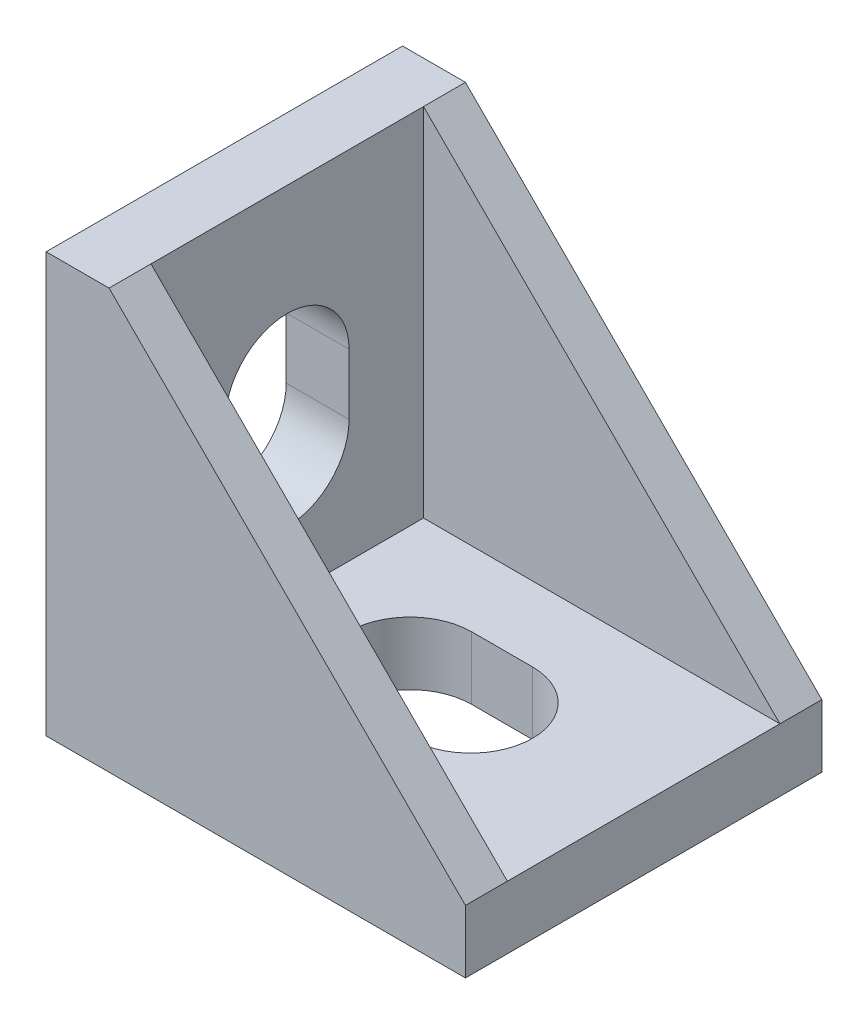
ISO-10303-21;
HEADER;
FILE_DESCRIPTION(('STEP AP214'),'2;1');
FILE_NAME('part.step','',(''),(''),'','','');
FILE_SCHEMA(('AUTOMOTIVE_DESIGN { 1 0 10303 214 1 1 1 1 }'));
ENDSEC;
DATA;
#1=APPLICATION_CONTEXT('core data for automotive mechanical design processes');
#2=APPLICATION_PROTOCOL_DEFINITION('international standard','automotive_design',2000,#1);
#3=PRODUCT_CONTEXT('',#1,'mechanical');
#4=PRODUCT('Part','Part','',(#3));
#5=PRODUCT_RELATED_PRODUCT_CATEGORY('part','',(#4));
#6=PRODUCT_DEFINITION_FORMATION('','',#4);
#7=PRODUCT_DEFINITION_CONTEXT('part definition',#1,'design');
#8=PRODUCT_DEFINITION('design','',#6,#7);
#9=PRODUCT_DEFINITION_SHAPE('','',#8);
#10=(LENGTH_UNIT() NAMED_UNIT(*) SI_UNIT(.MILLI.,.METRE.));
#11=(NAMED_UNIT(*) PLANE_ANGLE_UNIT() SI_UNIT($,.RADIAN.));
#12=(NAMED_UNIT(*) SI_UNIT($,.STERADIAN.) SOLID_ANGLE_UNIT());
#13=UNCERTAINTY_MEASURE_WITH_UNIT(LENGTH_MEASURE(1.E-05),#10,'distance_accuracy_value','');
#14=(GEOMETRIC_REPRESENTATION_CONTEXT(3) GLOBAL_UNCERTAINTY_ASSIGNED_CONTEXT((#13)) GLOBAL_UNIT_ASSIGNED_CONTEXT((#10,
#11,#12)) REPRESENTATION_CONTEXT('',''));
#15=CARTESIAN_POINT('',(0.,0.,0.));
#16=DIRECTION('',(0.,0.,1.));
#17=DIRECTION('',(1.,0.,0.));
#18=AXIS2_PLACEMENT_3D('',#15,#16,#17);
#19=CARTESIAN_POINT('',(3.,20.,17.));
#20=DIRECTION('',(-0.707106781186548,-0.707106781186548,0.));
#21=DIRECTION('',(0.707106781186548,-0.707106781186548,0.));
#22=AXIS2_PLACEMENT_3D('',#19,#20,#21);
#23=PLANE('',#22);
#24=DIRECTION('',(-0.707106781186548,0.707106781186548,0.));
#25=VECTOR('',#24,1.);
#26=CARTESIAN_POINT('',(3.,20.,2.));
#27=LINE('',#26,#25);
#28=CARTESIAN_POINT('',(20.,3.,2.));
#29=VERTEX_POINT('',#28);
#30=CARTESIAN_POINT('',(3.,20.,2.));
#31=VERTEX_POINT('',#30);
#32=EDGE_CURVE('E11',#29,#31,#27,.T.);
#33=ORIENTED_EDGE('',*,*,#32,.F.);
#34=DIRECTION('',(0.,0.,-1.));
#35=VECTOR('',#34,1.);
#36=CARTESIAN_POINT('',(20.,3.,17.));
#37=LINE('',#36,#35);
#38=CARTESIAN_POINT('',(20.,3.,0.));
#39=VERTEX_POINT('',#38);
#40=EDGE_CURVE('E264',#29,#39,#37,.T.);
#41=ORIENTED_EDGE('',*,*,#40,.T.);
#42=DIRECTION('',(-0.707106781186547,0.707106781186547,0.));
#43=VECTOR('',#42,1.);
#44=CARTESIAN_POINT('',(3.,20.,0.));
#45=LINE('',#44,#43);
#46=CARTESIAN_POINT('',(3.,20.,0.));
#47=VERTEX_POINT('',#46);
#48=EDGE_CURVE('E254',#39,#47,#45,.T.);
#49=ORIENTED_EDGE('',*,*,#48,.T.);
#50=DIRECTION('',(0.,0.,-1.));
#51=VECTOR('',#50,1.);
#52=CARTESIAN_POINT('',(3.,20.,17.));
#53=LINE('',#52,#51);
#54=EDGE_CURVE('E260',#31,#47,#53,.T.);
#55=ORIENTED_EDGE('',*,*,#54,.F.);
#56=EDGE_LOOP('',(#33,#41,#49,#55));
#57=FACE_BOUND('',#56,.T.);
#58=ADVANCED_FACE('F34',(#57),#23,.F.);
#59=CARTESIAN_POINT('',(0.,0.,17.));
#60=DIRECTION('',(1.,0.,0.));
#61=DIRECTION('',(0.,0.,-1.));
#62=AXIS2_PLACEMENT_3D('',#59,#60,#61);
#63=PLANE('',#62);
#64=DIRECTION('',(0.,-1.,0.));
#65=VECTOR('',#64,1.);
#66=CARTESIAN_POINT('',(0.,0.,5.55000000000001));
#67=LINE('',#66,#65);
#68=CARTESIAN_POINT('',(0.,11.75,5.55));
#69=VERTEX_POINT('',#68);
#70=CARTESIAN_POINT('',(0.,8.85,5.55));
#71=VERTEX_POINT('',#70);
#72=EDGE_CURVE('E157',#69,#71,#67,.T.);
#73=ORIENTED_EDGE('',*,*,#72,.F.);
#74=CARTESIAN_POINT('',(0.,11.75,8.5));
#75=DIRECTION('',(-1.,0.,0.));
#76=DIRECTION('',(0.,0.,1.));
#77=AXIS2_PLACEMENT_3D('',#74,#75,#76);
#78=CIRCLE('',#77,2.95);
#79=CARTESIAN_POINT('',(0.,11.75,11.45));
#80=VERTEX_POINT('',#79);
#81=EDGE_CURVE('E149',#80,#69,#78,.T.);
#82=ORIENTED_EDGE('',*,*,#81,.F.);
#83=DIRECTION('',(0.,-1.,0.));
#84=VECTOR('',#83,1.);
#85=CARTESIAN_POINT('',(0.,0.,11.45));
#86=LINE('',#85,#84);
#87=CARTESIAN_POINT('',(0.,8.85,11.45));
#88=VERTEX_POINT('',#87);
#89=EDGE_CURVE('E49',#80,#88,#86,.T.);
#90=ORIENTED_EDGE('',*,*,#89,.T.);
#91=CARTESIAN_POINT('',(0.,8.85,8.5));
#92=DIRECTION('',(-1.,0.,0.));
#93=DIRECTION('',(0.,0.,1.));
#94=AXIS2_PLACEMENT_3D('',#91,#92,#93);
#95=CIRCLE('',#94,2.95);
#96=EDGE_CURVE('E161',#71,#88,#95,.T.);
#97=ORIENTED_EDGE('',*,*,#96,.F.);
#98=EDGE_LOOP('',(#73,#82,#90,#97));
#99=FACE_BOUND('',#98,.T.);
#100=DIRECTION('',(0.,-1.,0.));
#101=VECTOR('',#100,1.);
#102=CARTESIAN_POINT('',(0.,0.,0.));
#103=LINE('',#102,#101);
#104=CARTESIAN_POINT('',(0.,20.,0.));
#105=VERTEX_POINT('',#104);
#106=CARTESIAN_POINT('',(0.,0.,0.));
#107=VERTEX_POINT('',#106);
#108=EDGE_CURVE('E232',#105,#107,#103,.T.);
#109=ORIENTED_EDGE('',*,*,#108,.T.);
#110=DIRECTION('',(0.,0.,-1.));
#111=VECTOR('',#110,1.);
#112=CARTESIAN_POINT('',(0.,0.,17.));
#113=LINE('',#112,#111);
#114=CARTESIAN_POINT('',(0.,0.,17.));
#115=VERTEX_POINT('',#114);
#116=EDGE_CURVE('E271',#115,#107,#113,.T.);
#117=ORIENTED_EDGE('',*,*,#116,.F.);
#118=DIRECTION('',(0.,-1.,0.));
#119=VECTOR('',#118,1.);
#120=CARTESIAN_POINT('',(0.,0.,17.));
#121=LINE('',#120,#119);
#122=CARTESIAN_POINT('',(0.,20.,17.));
#123=VERTEX_POINT('',#122);
#124=EDGE_CURVE('E234',#123,#115,#121,.T.);
#125=ORIENTED_EDGE('',*,*,#124,.F.);
#126=DIRECTION('',(0.,0.,-1.));
#127=VECTOR('',#126,1.);
#128=CARTESIAN_POINT('',(0.,20.,17.));
#129=LINE('',#128,#127);
#130=EDGE_CURVE('E246',#123,#105,#129,.T.);
#131=ORIENTED_EDGE('',*,*,#130,.T.);
#132=EDGE_LOOP('',(#109,#117,#125,#131));
#133=FACE_BOUND('',#132,.T.);
#134=ADVANCED_FACE('F36',(#99,#133),#63,.F.);
#135=CARTESIAN_POINT('',(0.,0.,17.));
#136=DIRECTION('',(0.,1.,0.));
#137=DIRECTION('',(0.,0.,1.));
#138=AXIS2_PLACEMENT_3D('',#135,#136,#137);
#139=PLANE('',#138);
#140=CARTESIAN_POINT('',(11.75,0.,8.5));
#141=DIRECTION('',(0.,1.,0.));
#142=DIRECTION('',(0.,0.,1.));
#143=AXIS2_PLACEMENT_3D('',#140,#141,#142);
#144=CIRCLE('',#143,2.95);
#145=CARTESIAN_POINT('',(11.75,0.,11.45));
#146=VERTEX_POINT('',#145);
#147=CARTESIAN_POINT('',(11.75,0.,5.55));
#148=VERTEX_POINT('',#147);
#149=EDGE_CURVE('E194',#146,#148,#144,.T.);
#150=ORIENTED_EDGE('',*,*,#149,.T.);
#151=DIRECTION('',(-1.,0.,0.));
#152=VECTOR('',#151,1.);
#153=CARTESIAN_POINT('',(0.,0.,5.55000000000001));
#154=LINE('',#153,#152);
#155=CARTESIAN_POINT('',(8.85,0.,5.55));
#156=VERTEX_POINT('',#155);
#157=EDGE_CURVE('E184',#148,#156,#154,.T.);
#158=ORIENTED_EDGE('',*,*,#157,.T.);
#159=CARTESIAN_POINT('',(8.85,0.,8.5));
#160=DIRECTION('',(0.,1.,0.));
#161=DIRECTION('',(0.,0.,1.));
#162=AXIS2_PLACEMENT_3D('',#159,#160,#161);
#163=CIRCLE('',#162,2.95);
#164=CARTESIAN_POINT('',(8.85,0.,11.45));
#165=VERTEX_POINT('',#164);
#166=EDGE_CURVE('E187',#156,#165,#163,.T.);
#167=ORIENTED_EDGE('',*,*,#166,.T.);
#168=DIRECTION('',(-1.,0.,0.));
#169=VECTOR('',#168,1.);
#170=CARTESIAN_POINT('',(0.,0.,11.45));
#171=LINE('',#170,#169);
#172=EDGE_CURVE('E191',#146,#165,#171,.T.);
#173=ORIENTED_EDGE('',*,*,#172,.F.);
#174=EDGE_LOOP('',(#150,#158,#167,#173));
#175=FACE_BOUND('',#174,.T.);
#176=DIRECTION('',(1.,0.,0.));
#177=VECTOR('',#176,1.);
#178=CARTESIAN_POINT('',(0.,0.,0.));
#179=LINE('',#178,#177);
#180=CARTESIAN_POINT('',(20.,0.,0.));
#181=VERTEX_POINT('',#180);
#182=EDGE_CURVE('E249',#107,#181,#179,.T.);
#183=ORIENTED_EDGE('',*,*,#182,.T.);
#184=DIRECTION('',(0.,0.,-1.));
#185=VECTOR('',#184,1.);
#186=CARTESIAN_POINT('',(20.,0.,17.));
#187=LINE('',#186,#185);
#188=CARTESIAN_POINT('',(20.,0.,17.));
#189=VERTEX_POINT('',#188);
#190=EDGE_CURVE('E268',#189,#181,#187,.T.);
#191=ORIENTED_EDGE('',*,*,#190,.F.);
#192=DIRECTION('',(1.,0.,0.));
#193=VECTOR('',#192,1.);
#194=CARTESIAN_POINT('',(0.,0.,17.));
#195=LINE('',#194,#193);
#196=EDGE_CURVE('E237',#115,#189,#195,.T.);
#197=ORIENTED_EDGE('',*,*,#196,.F.);
#198=ORIENTED_EDGE('',*,*,#116,.T.);
#199=EDGE_LOOP('',(#183,#191,#197,#198));
#200=FACE_BOUND('',#199,.T.);
#201=ADVANCED_FACE('F324',(#175,#200),#139,.F.);
#202=CARTESIAN_POINT('',(20.,0.,17.));
#203=DIRECTION('',(-1.,0.,0.));
#204=DIRECTION('',(0.,0.,1.));
#205=AXIS2_PLACEMENT_3D('',#202,#203,#204);
#206=PLANE('',#205);
#207=DIRECTION('',(0.,1.,0.));
#208=VECTOR('',#207,1.);
#209=CARTESIAN_POINT('',(20.,0.,0.));
#210=LINE('',#209,#208);
#211=EDGE_CURVE('E251',#181,#39,#210,.T.);
#212=ORIENTED_EDGE('',*,*,#211,.T.);
#213=ORIENTED_EDGE('',*,*,#40,.F.);
#214=DIRECTION('',(0.,0.,1.));
#215=VECTOR('',#214,1.);
#216=CARTESIAN_POINT('',(20.,3.,2.));
#217=LINE('',#216,#215);
#218=CARTESIAN_POINT('',(20.,3.,15.));
#219=VERTEX_POINT('',#218);
#220=EDGE_CURVE('E209',#29,#219,#217,.T.);
#221=ORIENTED_EDGE('',*,*,#220,.T.);
#222=CARTESIAN_POINT('',(20.,3.,17.));
#223=VERTEX_POINT('',#222);
#224=EDGE_CURVE('E265',#223,#219,#37,.T.);
#225=ORIENTED_EDGE('',*,*,#224,.F.);
#226=DIRECTION('',(0.,1.,0.));
#227=VECTOR('',#226,1.);
#228=CARTESIAN_POINT('',(20.,0.,17.));
#229=LINE('',#228,#227);
#230=EDGE_CURVE('E240',#189,#223,#229,.T.);
#231=ORIENTED_EDGE('',*,*,#230,.F.);
#232=ORIENTED_EDGE('',*,*,#190,.T.);
#233=EDGE_LOOP('',(#212,#213,#221,#225,#231,#232));
#234=FACE_BOUND('',#233,.T.);
#235=ADVANCED_FACE('F294',(#234),#206,.F.);
#236=ORIENTED_EDGE('',*,*,#224,.T.);
#237=DIRECTION('',(-0.707106781186548,0.707106781186548,0.));
#238=VECTOR('',#237,1.);
#239=CARTESIAN_POINT('',(3.,20.,15.));
#240=LINE('',#239,#238);
#241=CARTESIAN_POINT('',(3.,20.,15.));
#242=VERTEX_POINT('',#241);
#243=EDGE_CURVE('E42',#219,#242,#240,.T.);
#244=ORIENTED_EDGE('',*,*,#243,.T.);
#245=CARTESIAN_POINT('',(3.,20.,17.));
#246=VERTEX_POINT('',#245);
#247=EDGE_CURVE('E261',#246,#242,#53,.T.);
#248=ORIENTED_EDGE('',*,*,#247,.F.);
#249=DIRECTION('',(-0.707106781186547,0.707106781186547,0.));
#250=VECTOR('',#249,1.);
#251=CARTESIAN_POINT('',(3.,20.,17.));
#252=LINE('',#251,#250);
#253=EDGE_CURVE('E242',#223,#246,#252,.T.);
#254=ORIENTED_EDGE('',*,*,#253,.F.);
#255=EDGE_LOOP('',(#236,#244,#248,#254));
#256=FACE_BOUND('',#255,.T.);
#257=ADVANCED_FACE('F276',(#256),#23,.F.);
#258=CARTESIAN_POINT('',(0.,20.,17.));
#259=DIRECTION('',(0.,-1.,0.));
#260=DIRECTION('',(0.,0.,-1.));
#261=AXIS2_PLACEMENT_3D('',#258,#259,#260);
#262=PLANE('',#261);
#263=DIRECTION('',(-1.,0.,0.));
#264=VECTOR('',#263,1.);
#265=CARTESIAN_POINT('',(0.,20.,0.));
#266=LINE('',#265,#264);
#267=EDGE_CURVE('E238',#47,#105,#266,.T.);
#268=ORIENTED_EDGE('',*,*,#267,.T.);
#269=ORIENTED_EDGE('',*,*,#130,.F.);
#270=DIRECTION('',(-1.,0.,0.));
#271=VECTOR('',#270,1.);
#272=CARTESIAN_POINT('',(0.,20.,17.));
#273=LINE('',#272,#271);
#274=EDGE_CURVE('E244',#246,#123,#273,.T.);
#275=ORIENTED_EDGE('',*,*,#274,.F.);
#276=ORIENTED_EDGE('',*,*,#247,.T.);
#277=DIRECTION('',(0.,0.,1.));
#278=VECTOR('',#277,1.);
#279=CARTESIAN_POINT('',(3.,20.,2.));
#280=LINE('',#279,#278);
#281=EDGE_CURVE('E216',#31,#242,#280,.T.);
#282=ORIENTED_EDGE('',*,*,#281,.F.);
#283=ORIENTED_EDGE('',*,*,#54,.T.);
#284=EDGE_LOOP('',(#268,#269,#275,#276,#282,#283));
#285=FACE_BOUND('',#284,.T.);
#286=ADVANCED_FACE('F285',(#285),#262,.F.);
#287=CARTESIAN_POINT('',(0.,0.,17.));
#288=DIRECTION('',(0.,0.,-1.));
#289=DIRECTION('',(-1.,0.,0.));
#290=AXIS2_PLACEMENT_3D('',#287,#288,#289);
#291=PLANE('',#290);
#292=ORIENTED_EDGE('',*,*,#124,.T.);
#293=ORIENTED_EDGE('',*,*,#196,.T.);
#294=ORIENTED_EDGE('',*,*,#230,.T.);
#295=ORIENTED_EDGE('',*,*,#253,.T.);
#296=ORIENTED_EDGE('',*,*,#274,.T.);
#297=EDGE_LOOP('',(#292,#293,#294,#295,#296));
#298=FACE_BOUND('',#297,.T.);
#299=ADVANCED_FACE('F289',(#298),#291,.F.);
#300=CARTESIAN_POINT('',(0.,0.,0.));
#301=DIRECTION('',(0.,0.,-1.));
#302=DIRECTION('',(-1.,0.,0.));
#303=AXIS2_PLACEMENT_3D('',#300,#301,#302);
#304=PLANE('',#303);
#305=ORIENTED_EDGE('',*,*,#108,.F.);
#306=ORIENTED_EDGE('',*,*,#267,.F.);
#307=ORIENTED_EDGE('',*,*,#48,.F.);
#308=ORIENTED_EDGE('',*,*,#211,.F.);
#309=ORIENTED_EDGE('',*,*,#182,.F.);
#310=EDGE_LOOP('',(#305,#306,#307,#308,#309));
#311=FACE_BOUND('',#310,.T.);
#312=ADVANCED_FACE('F316',(#311),#304,.T.);
#313=CARTESIAN_POINT('',(20.,20.,2.));
#314=DIRECTION('',(0.,0.,1.));
#315=DIRECTION('',(1.,0.,0.));
#316=AXIS2_PLACEMENT_3D('',#313,#314,#315);
#317=PLANE('',#316);
#318=ORIENTED_EDGE('',*,*,#32,.T.);
#319=DIRECTION('',(0.,-1.,0.));
#320=VECTOR('',#319,1.);
#321=CARTESIAN_POINT('',(3.,20.,2.));
#322=LINE('',#321,#320);
#323=CARTESIAN_POINT('',(3.,3.,2.));
#324=VERTEX_POINT('',#323);
#325=EDGE_CURVE('E229',#31,#324,#322,.T.);
#326=ORIENTED_EDGE('',*,*,#325,.T.);
#327=DIRECTION('',(-1.,0.,0.));
#328=VECTOR('',#327,1.);
#329=CARTESIAN_POINT('',(20.,3.,2.));
#330=LINE('',#329,#328);
#331=EDGE_CURVE('E219',#29,#324,#330,.T.);
#332=ORIENTED_EDGE('',*,*,#331,.F.);
#333=EDGE_LOOP('',(#318,#326,#332));
#334=FACE_BOUND('',#333,.T.);
#335=ADVANCED_FACE('F303',(#334),#317,.T.);
#336=CARTESIAN_POINT('',(20.,20.,15.));
#337=DIRECTION('',(0.,0.,1.));
#338=DIRECTION('',(1.,0.,0.));
#339=AXIS2_PLACEMENT_3D('',#336,#337,#338);
#340=PLANE('',#339);
#341=DIRECTION('',(-1.,0.,0.));
#342=VECTOR('',#341,1.);
#343=CARTESIAN_POINT('',(20.,3.,15.));
#344=LINE('',#343,#342);
#345=CARTESIAN_POINT('',(3.,3.,15.));
#346=VERTEX_POINT('',#345);
#347=EDGE_CURVE('E222',#219,#346,#344,.T.);
#348=ORIENTED_EDGE('',*,*,#347,.T.);
#349=DIRECTION('',(0.,-1.,0.));
#350=VECTOR('',#349,1.);
#351=CARTESIAN_POINT('',(3.,20.,15.));
#352=LINE('',#351,#350);
#353=EDGE_CURVE('E218',#242,#346,#352,.T.);
#354=ORIENTED_EDGE('',*,*,#353,.F.);
#355=ORIENTED_EDGE('',*,*,#243,.F.);
#356=EDGE_LOOP('',(#348,#354,#355));
#357=FACE_BOUND('',#356,.T.);
#358=ADVANCED_FACE('F307',(#357),#340,.F.);
#359=CARTESIAN_POINT('',(3.,20.,2.));
#360=DIRECTION('',(1.,0.,0.));
#361=DIRECTION('',(0.,0.,-1.));
#362=AXIS2_PLACEMENT_3D('',#359,#360,#361);
#363=PLANE('',#362);
#364=CARTESIAN_POINT('',(3.,11.75,8.5));
#365=DIRECTION('',(-1.,0.,0.));
#366=DIRECTION('',(0.,0.,1.));
#367=AXIS2_PLACEMENT_3D('',#364,#365,#366);
#368=CIRCLE('',#367,2.95);
#369=CARTESIAN_POINT('',(3.,11.75,11.45));
#370=VERTEX_POINT('',#369);
#371=CARTESIAN_POINT('',(3.,11.75,5.55));
#372=VERTEX_POINT('',#371);
#373=EDGE_CURVE('E174',#370,#372,#368,.T.);
#374=ORIENTED_EDGE('',*,*,#373,.T.);
#375=DIRECTION('',(0.,-1.,0.));
#376=VECTOR('',#375,1.);
#377=CARTESIAN_POINT('',(3.,0.,5.55000000000001));
#378=LINE('',#377,#376);
#379=CARTESIAN_POINT('',(3.,8.85,5.55));
#380=VERTEX_POINT('',#379);
#381=EDGE_CURVE('E57',#372,#380,#378,.T.);
#382=ORIENTED_EDGE('',*,*,#381,.T.);
#383=CARTESIAN_POINT('',(3.,8.85,8.5));
#384=DIRECTION('',(-1.,0.,0.));
#385=DIRECTION('',(0.,0.,1.));
#386=AXIS2_PLACEMENT_3D('',#383,#384,#385);
#387=CIRCLE('',#386,2.95);
#388=CARTESIAN_POINT('',(3.,8.85,11.45));
#389=VERTEX_POINT('',#388);
#390=EDGE_CURVE('E165',#380,#389,#387,.T.);
#391=ORIENTED_EDGE('',*,*,#390,.T.);
#392=DIRECTION('',(0.,-1.,0.));
#393=VECTOR('',#392,1.);
#394=CARTESIAN_POINT('',(3.,0.,11.45));
#395=LINE('',#394,#393);
#396=EDGE_CURVE('E168',#370,#389,#395,.T.);
#397=ORIENTED_EDGE('',*,*,#396,.F.);
#398=EDGE_LOOP('',(#374,#382,#391,#397));
#399=FACE_BOUND('',#398,.T.);
#400=DIRECTION('',(0.,0.,1.));
#401=VECTOR('',#400,1.);
#402=CARTESIAN_POINT('',(3.,3.,2.));
#403=LINE('',#402,#401);
#404=EDGE_CURVE('E225',#324,#346,#403,.T.);
#405=ORIENTED_EDGE('',*,*,#404,.F.);
#406=ORIENTED_EDGE('',*,*,#325,.F.);
#407=ORIENTED_EDGE('',*,*,#281,.T.);
#408=ORIENTED_EDGE('',*,*,#353,.T.);
#409=EDGE_LOOP('',(#405,#406,#407,#408));
#410=FACE_BOUND('',#409,.T.);
#411=ADVANCED_FACE('F306',(#399,#410),#363,.T.);
#412=CARTESIAN_POINT('',(0.,3.,0.));
#413=DIRECTION('',(0.,-1.,0.));
#414=DIRECTION('',(0.,0.,-1.));
#415=AXIS2_PLACEMENT_3D('',#412,#413,#414);
#416=PLANE('',#415);
#417=CARTESIAN_POINT('',(8.85,3.,8.5));
#418=DIRECTION('',(0.,1.,0.));
#419=DIRECTION('',(0.,0.,1.));
#420=AXIS2_PLACEMENT_3D('',#417,#418,#419);
#421=CIRCLE('',#420,2.95);
#422=CARTESIAN_POINT('',(8.85,3.,5.55));
#423=VERTEX_POINT('',#422);
#424=CARTESIAN_POINT('',(8.85,3.,11.45));
#425=VERTEX_POINT('',#424);
#426=EDGE_CURVE('E199',#423,#425,#421,.T.);
#427=ORIENTED_EDGE('',*,*,#426,.F.);
#428=DIRECTION('',(-1.,0.,0.));
#429=VECTOR('',#428,1.);
#430=CARTESIAN_POINT('',(0.,3.,5.55000000000001));
#431=LINE('',#430,#429);
#432=CARTESIAN_POINT('',(11.75,3.,5.55));
#433=VERTEX_POINT('',#432);
#434=EDGE_CURVE('E180',#433,#423,#431,.T.);
#435=ORIENTED_EDGE('',*,*,#434,.F.);
#436=CARTESIAN_POINT('',(11.75,3.,8.5));
#437=DIRECTION('',(0.,1.,0.));
#438=DIRECTION('',(0.,0.,1.));
#439=AXIS2_PLACEMENT_3D('',#436,#437,#438);
#440=CIRCLE('',#439,2.95);
#441=CARTESIAN_POINT('',(11.75,3.,11.45));
#442=VERTEX_POINT('',#441);
#443=EDGE_CURVE('E188',#442,#433,#440,.T.);
#444=ORIENTED_EDGE('',*,*,#443,.F.);
#445=DIRECTION('',(-1.,0.,0.));
#446=VECTOR('',#445,1.);
#447=CARTESIAN_POINT('',(0.,3.,11.45));
#448=LINE('',#447,#446);
#449=EDGE_CURVE('E202',#442,#425,#448,.T.);
#450=ORIENTED_EDGE('',*,*,#449,.T.);
#451=EDGE_LOOP('',(#427,#435,#444,#450));
#452=FACE_BOUND('',#451,.T.);
#453=ORIENTED_EDGE('',*,*,#220,.F.);
#454=ORIENTED_EDGE('',*,*,#331,.T.);
#455=ORIENTED_EDGE('',*,*,#404,.T.);
#456=ORIENTED_EDGE('',*,*,#347,.F.);
#457=EDGE_LOOP('',(#453,#454,#455,#456));
#458=FACE_BOUND('',#457,.T.);
#459=ADVANCED_FACE('F299',(#452,#458),#416,.F.);
#460=CARTESIAN_POINT('',(0.,0.,5.55000000000001));
#461=DIRECTION('',(0.,0.,-1.));
#462=DIRECTION('',(-1.,0.,0.));
#463=AXIS2_PLACEMENT_3D('',#460,#461,#462);
#464=PLANE('',#463);
#465=ORIENTED_EDGE('',*,*,#434,.T.);
#466=DIRECTION('',(0.,1.,0.));
#467=VECTOR('',#466,1.);
#468=CARTESIAN_POINT('',(8.85,0.,5.55));
#469=LINE('',#468,#467);
#470=EDGE_CURVE('E197',#156,#423,#469,.T.);
#471=ORIENTED_EDGE('',*,*,#470,.F.);
#472=ORIENTED_EDGE('',*,*,#157,.F.);
#473=DIRECTION('',(0.,1.,0.));
#474=VECTOR('',#473,1.);
#475=CARTESIAN_POINT('',(11.75,0.,5.55));
#476=LINE('',#475,#474);
#477=EDGE_CURVE('E207',#148,#433,#476,.T.);
#478=ORIENTED_EDGE('',*,*,#477,.T.);
#479=EDGE_LOOP('',(#465,#471,#472,#478));
#480=FACE_BOUND('',#479,.T.);
#481=ADVANCED_FACE('F386',(#480),#464,.F.);
#482=CARTESIAN_POINT('',(11.75,0.,8.5));
#483=DIRECTION('',(0.,1.,0.));
#484=DIRECTION('',(0.,0.,1.));
#485=AXIS2_PLACEMENT_3D('',#482,#483,#484);
#486=CYLINDRICAL_SURFACE('',#485,2.95);
#487=ORIENTED_EDGE('',*,*,#443,.T.);
#488=ORIENTED_EDGE('',*,*,#477,.F.);
#489=ORIENTED_EDGE('',*,*,#149,.F.);
#490=DIRECTION('',(0.,1.,0.));
#491=VECTOR('',#490,1.);
#492=CARTESIAN_POINT('',(11.75,0.,11.45));
#493=LINE('',#492,#491);
#494=EDGE_CURVE('E210',#146,#442,#493,.T.);
#495=ORIENTED_EDGE('',*,*,#494,.T.);
#496=EDGE_LOOP('',(#487,#488,#489,#495));
#497=FACE_BOUND('',#496,.T.);
#498=ADVANCED_FACE('F396',(#497),#486,.F.);
#499=CARTESIAN_POINT('',(0.,0.,11.45));
#500=DIRECTION('',(0.,0.,-1.));
#501=DIRECTION('',(-1.,0.,0.));
#502=AXIS2_PLACEMENT_3D('',#499,#500,#501);
#503=PLANE('',#502);
#504=ORIENTED_EDGE('',*,*,#449,.F.);
#505=ORIENTED_EDGE('',*,*,#494,.F.);
#506=ORIENTED_EDGE('',*,*,#172,.T.);
#507=DIRECTION('',(0.,1.,0.));
#508=VECTOR('',#507,1.);
#509=CARTESIAN_POINT('',(8.85,0.,11.45));
#510=LINE('',#509,#508);
#511=EDGE_CURVE('E212',#165,#425,#510,.T.);
#512=ORIENTED_EDGE('',*,*,#511,.T.);
#513=EDGE_LOOP('',(#504,#505,#506,#512));
#514=FACE_BOUND('',#513,.T.);
#515=ADVANCED_FACE('F406',(#514),#503,.T.);
#516=CARTESIAN_POINT('',(8.85,0.,8.5));
#517=DIRECTION('',(0.,1.,0.));
#518=DIRECTION('',(0.,0.,1.));
#519=AXIS2_PLACEMENT_3D('',#516,#517,#518);
#520=CYLINDRICAL_SURFACE('',#519,2.95);
#521=ORIENTED_EDGE('',*,*,#426,.T.);
#522=ORIENTED_EDGE('',*,*,#511,.F.);
#523=ORIENTED_EDGE('',*,*,#166,.F.);
#524=ORIENTED_EDGE('',*,*,#470,.T.);
#525=EDGE_LOOP('',(#521,#522,#523,#524));
#526=FACE_BOUND('',#525,.T.);
#527=ADVANCED_FACE('F416',(#526),#520,.F.);
#528=CARTESIAN_POINT('',(0.,0.,5.55000000000001));
#529=DIRECTION('',(0.,0.,1.));
#530=DIRECTION('',(0.,-1.,0.));
#531=AXIS2_PLACEMENT_3D('',#528,#529,#530);
#532=PLANE('',#531);
#533=ORIENTED_EDGE('',*,*,#381,.F.);
#534=DIRECTION('',(1.,0.,0.));
#535=VECTOR('',#534,1.);
#536=CARTESIAN_POINT('',(0.,11.75,5.55));
#537=LINE('',#536,#535);
#538=EDGE_CURVE('E152',#69,#372,#537,.T.);
#539=ORIENTED_EDGE('',*,*,#538,.F.);
#540=ORIENTED_EDGE('',*,*,#72,.T.);
#541=DIRECTION('',(1.,0.,0.));
#542=VECTOR('',#541,1.);
#543=CARTESIAN_POINT('',(0.,8.85,5.55));
#544=LINE('',#543,#542);
#545=EDGE_CURVE('E178',#71,#380,#544,.T.);
#546=ORIENTED_EDGE('',*,*,#545,.T.);
#547=EDGE_LOOP('',(#533,#539,#540,#546));
#548=FACE_BOUND('',#547,.T.);
#549=ADVANCED_FACE('F159',(#548),#532,.T.);
#550=CARTESIAN_POINT('',(0.,8.85,8.5));
#551=DIRECTION('',(1.,0.,0.));
#552=DIRECTION('',(0.,1.,0.));
#553=AXIS2_PLACEMENT_3D('',#550,#551,#552);
#554=CYLINDRICAL_SURFACE('',#553,2.95);
#555=ORIENTED_EDGE('',*,*,#390,.F.);
#556=ORIENTED_EDGE('',*,*,#545,.F.);
#557=ORIENTED_EDGE('',*,*,#96,.T.);
#558=DIRECTION('',(1.,0.,0.));
#559=VECTOR('',#558,1.);
#560=CARTESIAN_POINT('',(0.,8.85,11.45));
#561=LINE('',#560,#559);
#562=EDGE_CURVE('E181',#88,#389,#561,.T.);
#563=ORIENTED_EDGE('',*,*,#562,.T.);
#564=EDGE_LOOP('',(#555,#556,#557,#563));
#565=FACE_BOUND('',#564,.T.);
#566=ADVANCED_FACE('F445',(#565),#554,.F.);
#567=CARTESIAN_POINT('',(0.,0.,11.45));
#568=DIRECTION('',(0.,0.,1.));
#569=DIRECTION('',(0.,-1.,0.));
#570=AXIS2_PLACEMENT_3D('',#567,#568,#569);
#571=PLANE('',#570);
#572=ORIENTED_EDGE('',*,*,#396,.T.);
#573=ORIENTED_EDGE('',*,*,#562,.F.);
#574=ORIENTED_EDGE('',*,*,#89,.F.);
#575=DIRECTION('',(1.,0.,0.));
#576=VECTOR('',#575,1.);
#577=CARTESIAN_POINT('',(0.,11.75,11.45));
#578=LINE('',#577,#576);
#579=EDGE_CURVE('E154',#80,#370,#578,.T.);
#580=ORIENTED_EDGE('',*,*,#579,.T.);
#581=EDGE_LOOP('',(#572,#573,#574,#580));
#582=FACE_BOUND('',#581,.T.);
#583=ADVANCED_FACE('F454',(#582),#571,.F.);
#584=CARTESIAN_POINT('',(0.,11.75,8.5));
#585=DIRECTION('',(1.,0.,0.));
#586=DIRECTION('',(0.,1.,0.));
#587=AXIS2_PLACEMENT_3D('',#584,#585,#586);
#588=CYLINDRICAL_SURFACE('',#587,2.95);
#589=ORIENTED_EDGE('',*,*,#373,.F.);
#590=ORIENTED_EDGE('',*,*,#579,.F.);
#591=ORIENTED_EDGE('',*,*,#81,.T.);
#592=ORIENTED_EDGE('',*,*,#538,.T.);
#593=EDGE_LOOP('',(#589,#590,#591,#592));
#594=FACE_BOUND('',#593,.T.);
#595=ADVANCED_FACE('F151',(#594),#588,.F.);
#596=CLOSED_SHELL('',(#58,#134,#201,#235,#257,#286,#299,#312,#335,#358,#411,#459,#481,#498,#515,
#527,#549,#566,#583,#595));
#597=MANIFOLD_SOLID_BREP('B2',#596);
#598=ADVANCED_BREP_SHAPE_REPRESENTATION('',(#18,#597),#14);
#599=SHAPE_DEFINITION_REPRESENTATION(#9,#598);
ENDSEC;
END-ISO-10303-21;
